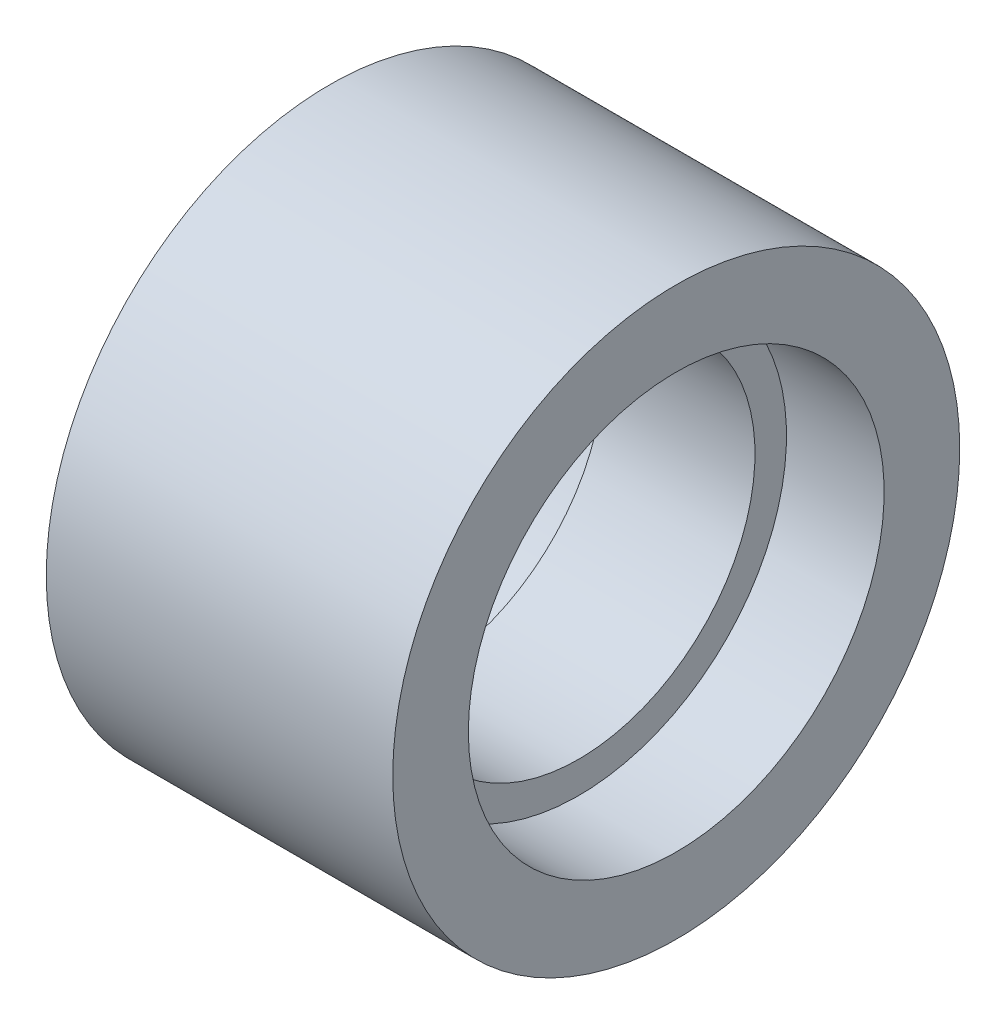
ISO-10303-21;
HEADER;
FILE_DESCRIPTION(('STEP AP214'),'2;1');
FILE_NAME('part.step','',(''),(''),'','','');
FILE_SCHEMA(('AUTOMOTIVE_DESIGN { 1 0 10303 214 1 1 1 1 }'));
ENDSEC;
DATA;
#1=APPLICATION_CONTEXT('core data for automotive mechanical design processes');
#2=APPLICATION_PROTOCOL_DEFINITION('international standard','automotive_design',2000,#1);
#3=PRODUCT_CONTEXT('',#1,'mechanical');
#4=PRODUCT('Part','Part','',(#3));
#5=PRODUCT_RELATED_PRODUCT_CATEGORY('part','',(#4));
#6=PRODUCT_DEFINITION_FORMATION('','',#4);
#7=PRODUCT_DEFINITION_CONTEXT('part definition',#1,'design');
#8=PRODUCT_DEFINITION('design','',#6,#7);
#9=PRODUCT_DEFINITION_SHAPE('','',#8);
#10=(LENGTH_UNIT() NAMED_UNIT(*) SI_UNIT(.MILLI.,.METRE.));
#11=(NAMED_UNIT(*) PLANE_ANGLE_UNIT() SI_UNIT($,.RADIAN.));
#12=(NAMED_UNIT(*) SI_UNIT($,.STERADIAN.) SOLID_ANGLE_UNIT());
#13=UNCERTAINTY_MEASURE_WITH_UNIT(LENGTH_MEASURE(1.E-05),#10,'distance_accuracy_value','');
#14=(GEOMETRIC_REPRESENTATION_CONTEXT(3) GLOBAL_UNCERTAINTY_ASSIGNED_CONTEXT((#13)) GLOBAL_UNIT_ASSIGNED_CONTEXT((#10,
#11,#12)) REPRESENTATION_CONTEXT('',''));
#15=CARTESIAN_POINT('',(0.,0.,0.));
#16=DIRECTION('',(0.,0.,1.));
#17=DIRECTION('',(1.,0.,0.));
#18=AXIS2_PLACEMENT_3D('',#15,#16,#17);
#19=CARTESIAN_POINT('',(55.,0.,0.));
#20=DIRECTION('',(1.,0.,0.));
#21=DIRECTION('',(0.,0.,-1.));
#22=AXIS2_PLACEMENT_3D('',#19,#20,#21);
#23=PLANE('',#22);
#24=CARTESIAN_POINT('',(55.,0.,0.));
#25=DIRECTION('',(-1.,0.,0.));
#26=DIRECTION('',(0.,0.,1.));
#27=AXIS2_PLACEMENT_3D('',#24,#25,#26);
#28=CIRCLE('',#27,66.);
#29=CARTESIAN_POINT('',(55.,0.,66.));
#30=VERTEX_POINT('',#29);
#31=EDGE_CURVE('E69',#30,#30,#28,.T.);
#32=ORIENTED_EDGE('',*,*,#31,.T.);
#33=EDGE_LOOP('',(#32));
#34=FACE_BOUND('',#33,.T.);
#35=CARTESIAN_POINT('',(55.,0.,0.));
#36=DIRECTION('',(-1.,0.,0.));
#37=DIRECTION('',(0.,0.,1.));
#38=AXIS2_PLACEMENT_3D('',#35,#36,#37);
#39=CIRCLE('',#38,90.);
#40=CARTESIAN_POINT('',(55.,0.,90.));
#41=VERTEX_POINT('',#40);
#42=EDGE_CURVE('E10',#41,#41,#39,.T.);
#43=ORIENTED_EDGE('',*,*,#42,.F.);
#44=EDGE_LOOP('',(#43));
#45=FACE_BOUND('',#44,.T.);
#46=ADVANCED_FACE('F41',(#34,#45),#23,.T.);
#47=CARTESIAN_POINT('',(-9.44444444444443,0.,0.));
#48=DIRECTION('',(-1.,0.,0.));
#49=DIRECTION('',(0.,0.,1.));
#50=AXIS2_PLACEMENT_3D('',#47,#48,#49);
#51=CYLINDRICAL_SURFACE('',#50,90.);
#52=ORIENTED_EDGE('',*,*,#42,.T.);
#53=EDGE_LOOP('',(#52));
#54=FACE_BOUND('',#53,.T.);
#55=CARTESIAN_POINT('',(-55.,0.,0.));
#56=DIRECTION('',(-1.,0.,0.));
#57=DIRECTION('',(0.,0.,1.));
#58=AXIS2_PLACEMENT_3D('',#55,#56,#57);
#59=CIRCLE('',#58,90.);
#60=CARTESIAN_POINT('',(-55.,0.,90.));
#61=VERTEX_POINT('',#60);
#62=EDGE_CURVE('E47',#61,#61,#59,.T.);
#63=ORIENTED_EDGE('',*,*,#62,.F.);
#64=EDGE_LOOP('',(#63));
#65=FACE_BOUND('',#64,.T.);
#66=ADVANCED_FACE('F105',(#54,#65),#51,.T.);
#67=CARTESIAN_POINT('',(-55.,0.,0.));
#68=DIRECTION('',(1.,0.,0.));
#69=DIRECTION('',(0.,0.,-1.));
#70=AXIS2_PLACEMENT_3D('',#67,#68,#69);
#71=PLANE('',#70);
#72=CARTESIAN_POINT('',(-55.,0.,0.));
#73=DIRECTION('',(-1.,0.,0.));
#74=DIRECTION('',(0.,0.,1.));
#75=AXIS2_PLACEMENT_3D('',#72,#73,#74);
#76=CIRCLE('',#75,66.);
#77=CARTESIAN_POINT('',(-55.,0.,66.));
#78=VERTEX_POINT('',#77);
#79=EDGE_CURVE('E51',#78,#78,#76,.T.);
#80=ORIENTED_EDGE('',*,*,#79,.F.);
#81=EDGE_LOOP('',(#80));
#82=FACE_BOUND('',#81,.T.);
#83=ORIENTED_EDGE('',*,*,#62,.T.);
#84=EDGE_LOOP('',(#83));
#85=FACE_BOUND('',#84,.T.);
#86=ADVANCED_FACE('F101',(#82,#85),#71,.F.);
#87=CARTESIAN_POINT('',(-9.44444444444443,0.,0.));
#88=DIRECTION('',(-1.,0.,0.));
#89=DIRECTION('',(0.,0.,1.));
#90=AXIS2_PLACEMENT_3D('',#87,#88,#89);
#91=CYLINDRICAL_SURFACE('',#90,66.);
#92=CARTESIAN_POINT('',(-24.,0.,0.));
#93=DIRECTION('',(-1.,0.,0.));
#94=DIRECTION('',(0.,0.,1.));
#95=AXIS2_PLACEMENT_3D('',#92,#93,#94);
#96=CIRCLE('',#95,66.);
#97=CARTESIAN_POINT('',(-24.,0.,66.));
#98=VERTEX_POINT('',#97);
#99=EDGE_CURVE('E55',#98,#98,#96,.T.);
#100=ORIENTED_EDGE('',*,*,#99,.F.);
#101=EDGE_LOOP('',(#100));
#102=FACE_BOUND('',#101,.T.);
#103=ORIENTED_EDGE('',*,*,#79,.T.);
#104=EDGE_LOOP('',(#103));
#105=FACE_BOUND('',#104,.T.);
#106=ADVANCED_FACE('F80',(#102,#105),#91,.F.);
#107=CARTESIAN_POINT('',(-24.,0.,0.));
#108=DIRECTION('',(-1.,0.,0.));
#109=DIRECTION('',(0.,0.,1.));
#110=AXIS2_PLACEMENT_3D('',#107,#108,#109);
#111=PLANE('',#110);
#112=ORIENTED_EDGE('',*,*,#99,.T.);
#113=EDGE_LOOP('',(#112));
#114=FACE_BOUND('',#113,.T.);
#115=CARTESIAN_POINT('',(-24.,0.,0.));
#116=DIRECTION('',(-1.,0.,0.));
#117=DIRECTION('',(0.,0.,1.));
#118=AXIS2_PLACEMENT_3D('',#115,#116,#117);
#119=CIRCLE('',#118,56.);
#120=CARTESIAN_POINT('',(-24.,0.,56.));
#121=VERTEX_POINT('',#120);
#122=EDGE_CURVE('E60',#121,#121,#119,.T.);
#123=ORIENTED_EDGE('',*,*,#122,.F.);
#124=EDGE_LOOP('',(#123));
#125=FACE_BOUND('',#124,.T.);
#126=ADVANCED_FACE('F91',(#114,#125),#111,.T.);
#127=CARTESIAN_POINT('',(-9.44444444444443,0.,0.));
#128=DIRECTION('',(-1.,0.,0.));
#129=DIRECTION('',(0.,0.,1.));
#130=AXIS2_PLACEMENT_3D('',#127,#128,#129);
#131=CYLINDRICAL_SURFACE('',#130,56.);
#132=CARTESIAN_POINT('',(24.,0.,0.));
#133=DIRECTION('',(-1.,0.,0.));
#134=DIRECTION('',(0.,0.,1.));
#135=AXIS2_PLACEMENT_3D('',#132,#133,#134);
#136=CIRCLE('',#135,56.);
#137=CARTESIAN_POINT('',(24.,0.,56.));
#138=VERTEX_POINT('',#137);
#139=EDGE_CURVE('E63',#138,#138,#136,.T.);
#140=ORIENTED_EDGE('',*,*,#139,.F.);
#141=EDGE_LOOP('',(#140));
#142=FACE_BOUND('',#141,.T.);
#143=ORIENTED_EDGE('',*,*,#122,.T.);
#144=EDGE_LOOP('',(#143));
#145=FACE_BOUND('',#144,.T.);
#146=ADVANCED_FACE('F85',(#142,#145),#131,.F.);
#147=CARTESIAN_POINT('',(24.,0.,0.));
#148=DIRECTION('',(-1.,0.,0.));
#149=DIRECTION('',(0.,0.,1.));
#150=AXIS2_PLACEMENT_3D('',#147,#148,#149);
#151=PLANE('',#150);
#152=CARTESIAN_POINT('',(24.,0.,0.));
#153=DIRECTION('',(-1.,0.,0.));
#154=DIRECTION('',(0.,0.,1.));
#155=AXIS2_PLACEMENT_3D('',#152,#153,#154);
#156=CIRCLE('',#155,66.);
#157=CARTESIAN_POINT('',(24.,0.,66.));
#158=VERTEX_POINT('',#157);
#159=EDGE_CURVE('E66',#158,#158,#156,.T.);
#160=ORIENTED_EDGE('',*,*,#159,.F.);
#161=EDGE_LOOP('',(#160));
#162=FACE_BOUND('',#161,.T.);
#163=ORIENTED_EDGE('',*,*,#139,.T.);
#164=EDGE_LOOP('',(#163));
#165=FACE_BOUND('',#164,.T.);
#166=ADVANCED_FACE('F78',(#162,#165),#151,.F.);
#167=ORIENTED_EDGE('',*,*,#31,.F.);
#168=EDGE_LOOP('',(#167));
#169=FACE_BOUND('',#168,.T.);
#170=ORIENTED_EDGE('',*,*,#159,.T.);
#171=EDGE_LOOP('',(#170));
#172=FACE_BOUND('',#171,.T.);
#173=ADVANCED_FACE('F75',(#169,#172),#91,.F.);
#174=CLOSED_SHELL('',(#46,#66,#86,#106,#126,#146,#166,#173));
#175=MANIFOLD_SOLID_BREP('B2',#174);
#176=ADVANCED_BREP_SHAPE_REPRESENTATION('',(#18,#175),#14);
#177=SHAPE_DEFINITION_REPRESENTATION(#9,#176);
ENDSEC;
END-ISO-10303-21;
